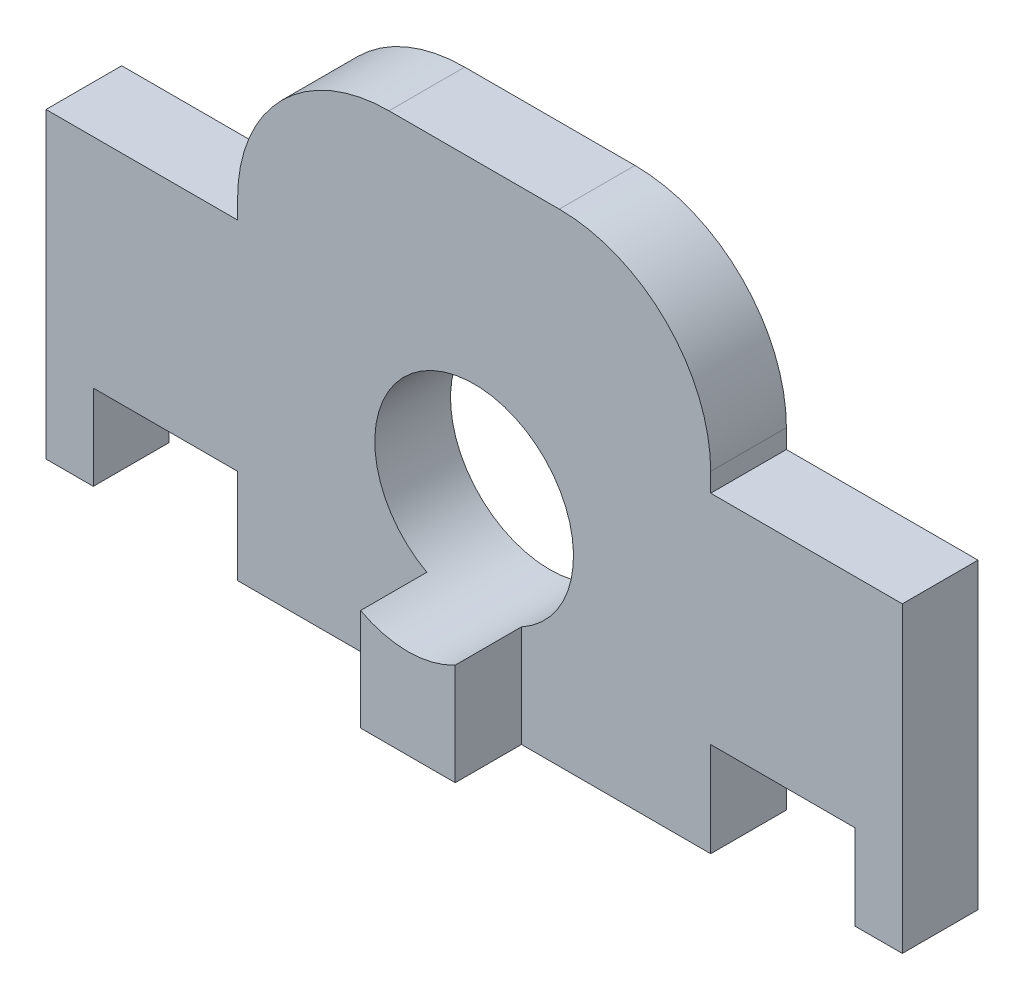
ISO-10303-21;
HEADER;
FILE_DESCRIPTION(('STEP AP214'),'2;1');
FILE_NAME('part.step','',(''),(''),'','','');
FILE_SCHEMA(('AUTOMOTIVE_DESIGN { 1 0 10303 214 1 1 1 1 }'));
ENDSEC;
DATA;
#1=APPLICATION_CONTEXT('core data for automotive mechanical design processes');
#2=APPLICATION_PROTOCOL_DEFINITION('international standard','automotive_design',2000,#1);
#3=PRODUCT_CONTEXT('',#1,'mechanical');
#4=PRODUCT('Part','Part','',(#3));
#5=PRODUCT_RELATED_PRODUCT_CATEGORY('part','',(#4));
#6=PRODUCT_DEFINITION_FORMATION('','',#4);
#7=PRODUCT_DEFINITION_CONTEXT('part definition',#1,'design');
#8=PRODUCT_DEFINITION('design','',#6,#7);
#9=PRODUCT_DEFINITION_SHAPE('','',#8);
#10=(LENGTH_UNIT() NAMED_UNIT(*) SI_UNIT(.MILLI.,.METRE.));
#11=(NAMED_UNIT(*) PLANE_ANGLE_UNIT() SI_UNIT($,.RADIAN.));
#12=(NAMED_UNIT(*) SI_UNIT($,.STERADIAN.) SOLID_ANGLE_UNIT());
#13=UNCERTAINTY_MEASURE_WITH_UNIT(LENGTH_MEASURE(1.E-05),#10,'distance_accuracy_value','');
#14=(GEOMETRIC_REPRESENTATION_CONTEXT(3) GLOBAL_UNCERTAINTY_ASSIGNED_CONTEXT((#13)) GLOBAL_UNIT_ASSIGNED_CONTEXT((#10,
#11,#12)) REPRESENTATION_CONTEXT('',''));
#15=CARTESIAN_POINT('',(0.,0.,0.));
#16=DIRECTION('',(0.,0.,1.));
#17=DIRECTION('',(1.,0.,0.));
#18=AXIS2_PLACEMENT_3D('',#15,#16,#17);
#19=CARTESIAN_POINT('',(0.,-37.205169628433,15.));
#20=DIRECTION('',(0.,1.,0.));
#21=DIRECTION('',(0.,0.,1.));
#22=AXIS2_PLACEMENT_3D('',#19,#20,#21);
#23=PLANE('',#22);
#24=DIRECTION('',(0.,0.,1.));
#25=VECTOR('',#24,1.);
#26=CARTESIAN_POINT('',(-3.92568659127626,-37.205169628433,8.));
#27=LINE('',#26,#25);
#28=CARTESIAN_POINT('',(-3.92568659127626,-37.205169628433,8.));
#29=VERTEX_POINT('',#28);
#30=CARTESIAN_POINT('',(-3.92568659127626,-37.205169628433,15.));
#31=VERTEX_POINT('',#30);
#32=EDGE_CURVE('E350',#29,#31,#27,.T.);
#33=ORIENTED_EDGE('',*,*,#32,.F.);
#34=DIRECTION('',(1.,0.,0.));
#35=VECTOR('',#34,1.);
#36=CARTESIAN_POINT('',(0.,-37.205169628433,8.));
#37=LINE('',#36,#35);
#38=CARTESIAN_POINT('',(-23.9256865912763,-37.205169628433,8.));
#39=VERTEX_POINT('',#38);
#40=EDGE_CURVE('E296',#39,#29,#37,.T.);
#41=ORIENTED_EDGE('',*,*,#40,.F.);
#42=DIRECTION('',(0.,0.,1.));
#43=VECTOR('',#42,1.);
#44=CARTESIAN_POINT('',(-23.9256865912763,-37.205169628433,0.));
#45=LINE('',#44,#43);
#46=CARTESIAN_POINT('',(-23.9256865912763,-37.205169628433,0.));
#47=VERTEX_POINT('',#46);
#48=EDGE_CURVE('E397',#47,#39,#45,.T.);
#49=ORIENTED_EDGE('',*,*,#48,.F.);
#50=DIRECTION('',(1.,0.,0.));
#51=VECTOR('',#50,1.);
#52=CARTESIAN_POINT('',(0.,-37.205169628433,0.));
#53=LINE('',#52,#51);
#54=CARTESIAN_POINT('',(26.0743134087237,-37.205169628433,0.));
#55=VERTEX_POINT('',#54);
#56=EDGE_CURVE('E423',#47,#55,#53,.T.);
#57=ORIENTED_EDGE('',*,*,#56,.T.);
#58=DIRECTION('',(0.,0.,1.));
#59=VECTOR('',#58,1.);
#60=CARTESIAN_POINT('',(26.0743134087237,-37.205169628433,0.));
#61=LINE('',#60,#59);
#62=CARTESIAN_POINT('',(26.0743134087237,-37.205169628433,8.));
#63=VERTEX_POINT('',#62);
#64=EDGE_CURVE('E359',#55,#63,#61,.T.);
#65=ORIENTED_EDGE('',*,*,#64,.T.);
#66=CARTESIAN_POINT('',(6.07431340872374,-37.205169628433,8.));
#67=VERTEX_POINT('',#66);
#68=EDGE_CURVE('E291',#67,#63,#37,.T.);
#69=ORIENTED_EDGE('',*,*,#68,.F.);
#70=DIRECTION('',(0.,0.,1.));
#71=VECTOR('',#70,1.);
#72=CARTESIAN_POINT('',(6.07431340872374,-37.205169628433,8.));
#73=LINE('',#72,#71);
#74=CARTESIAN_POINT('',(6.07431340872374,-37.205169628433,15.));
#75=VERTEX_POINT('',#74);
#76=EDGE_CURVE('E335',#67,#75,#73,.T.);
#77=ORIENTED_EDGE('',*,*,#76,.T.);
#78=DIRECTION('',(1.,0.,0.));
#79=VECTOR('',#78,1.);
#80=CARTESIAN_POINT('',(0.,-37.205169628433,15.));
#81=LINE('',#80,#79);
#82=EDGE_CURVE('E56',#31,#75,#81,.T.);
#83=ORIENTED_EDGE('',*,*,#82,.F.);
#84=EDGE_LOOP('',(#33,#41,#49,#57,#65,#69,#77,#83));
#85=FACE_BOUND('',#84,.T.);
#86=ADVANCED_FACE('F47',(#85),#23,.F.);
#87=CARTESIAN_POINT('',(0.,13.794830371567,15.));
#88=DIRECTION('',(0.,1.,0.));
#89=DIRECTION('',(0.,0.,1.));
#90=AXIS2_PLACEMENT_3D('',#87,#88,#89);
#91=PLANE('',#90);
#92=DIRECTION('',(0.,0.,1.));
#93=VECTOR('',#92,1.);
#94=CARTESIAN_POINT('',(-7.92568659127614,13.794830371567,0.));
#95=LINE('',#94,#93);
#96=CARTESIAN_POINT('',(-7.92568659127614,13.794830371567,0.));
#97=VERTEX_POINT('',#96);
#98=CARTESIAN_POINT('',(-7.92568659127614,13.794830371567,8.));
#99=VERTEX_POINT('',#98);
#100=EDGE_CURVE('E418',#97,#99,#95,.T.);
#101=ORIENTED_EDGE('',*,*,#100,.T.);
#102=DIRECTION('',(-1.,0.,0.));
#103=VECTOR('',#102,1.);
#104=CARTESIAN_POINT('',(0.,13.794830371567,8.));
#105=LINE('',#104,#103);
#106=CARTESIAN_POINT('',(10.0743134087236,13.794830371567,8.));
#107=VERTEX_POINT('',#106);
#108=EDGE_CURVE('E310',#107,#99,#105,.T.);
#109=ORIENTED_EDGE('',*,*,#108,.F.);
#110=DIRECTION('',(0.,0.,1.));
#111=VECTOR('',#110,1.);
#112=CARTESIAN_POINT('',(10.0743134087236,13.794830371567,0.));
#113=LINE('',#112,#111);
#114=CARTESIAN_POINT('',(10.0743134087236,13.794830371567,0.));
#115=VERTEX_POINT('',#114);
#116=EDGE_CURVE('E372',#115,#107,#113,.T.);
#117=ORIENTED_EDGE('',*,*,#116,.F.);
#118=DIRECTION('',(1.,0.,0.));
#119=VECTOR('',#118,1.);
#120=CARTESIAN_POINT('',(0.,13.794830371567,0.));
#121=LINE('',#120,#119);
#122=EDGE_CURVE('E436',#97,#115,#121,.T.);
#123=ORIENTED_EDGE('',*,*,#122,.F.);
#124=EDGE_LOOP('',(#101,#109,#117,#123));
#125=FACE_BOUND('',#124,.T.);
#126=ADVANCED_FACE('F483',(#125),#91,.T.);
#127=CARTESIAN_POINT('',(0.,0.,15.));
#128=DIRECTION('',(0.,0.,1.));
#129=DIRECTION('',(1.,0.,0.));
#130=AXIS2_PLACEMENT_3D('',#127,#128,#129);
#131=PLANE('',#130);
#132=ORIENTED_EDGE('',*,*,#82,.T.);
#133=DIRECTION('',(0.,1.,0.));
#134=VECTOR('',#133,1.);
#135=CARTESIAN_POINT('',(6.07431340872374,0.,15.));
#136=LINE('',#135,#134);
#137=CARTESIAN_POINT('',(6.07431340872374,-26.4382622847427,15.));
#138=VERTEX_POINT('',#137);
#139=EDGE_CURVE('E287',#75,#138,#136,.T.);
#140=ORIENTED_EDGE('',*,*,#139,.T.);
#141=CARTESIAN_POINT('',(1.07431340872375,-17.205169628433,15.));
#142=DIRECTION('',(0.,0.,1.));
#143=DIRECTION('',(1.,0.,0.));
#144=AXIS2_PLACEMENT_3D('',#141,#142,#143);
#145=CIRCLE('',#144,10.5);
#146=CARTESIAN_POINT('',(-3.92568659127626,-26.4382622847426,15.));
#147=VERTEX_POINT('',#146);
#148=EDGE_CURVE('E11',#147,#138,#145,.T.);
#149=ORIENTED_EDGE('',*,*,#148,.F.);
#150=DIRECTION('',(0.,-1.,0.));
#151=VECTOR('',#150,1.);
#152=CARTESIAN_POINT('',(-3.92568659127626,0.,15.));
#153=LINE('',#152,#151);
#154=EDGE_CURVE('E292',#147,#31,#153,.T.);
#155=ORIENTED_EDGE('',*,*,#154,.T.);
#156=EDGE_LOOP('',(#132,#140,#149,#155));
#157=FACE_BOUND('',#156,.T.);
#158=ADVANCED_FACE('F452',(#157),#131,.T.);
#159=CARTESIAN_POINT('',(1.07431340872375,-17.205169628433,15.));
#160=DIRECTION('',(0.,0.,-1.));
#161=DIRECTION('',(-1.,0.,0.));
#162=AXIS2_PLACEMENT_3D('',#159,#160,#161);
#163=CYLINDRICAL_SURFACE('',#162,10.5);
#164=CARTESIAN_POINT('',(1.07431340872375,-17.205169628433,0.));
#165=DIRECTION('',(0.,0.,1.));
#166=DIRECTION('',(1.,0.,0.));
#167=AXIS2_PLACEMENT_3D('',#164,#165,#166);
#168=CIRCLE('',#167,10.5);
#169=CARTESIAN_POINT('',(11.5743134087238,-17.205169628433,0.));
#170=VERTEX_POINT('',#169);
#171=EDGE_CURVE('E50',#170,#170,#168,.T.);
#172=ORIENTED_EDGE('',*,*,#171,.F.);
#173=EDGE_LOOP('',(#172));
#174=FACE_BOUND('',#173,.T.);
#175=ORIENTED_EDGE('',*,*,#148,.T.);
#176=DIRECTION('',(0.,0.,1.));
#177=VECTOR('',#176,1.);
#178=CARTESIAN_POINT('',(6.07431340872374,-26.4382622847427,8.));
#179=LINE('',#178,#177);
#180=CARTESIAN_POINT('',(6.07431340872374,-26.4382622847427,8.));
#181=VERTEX_POINT('',#180);
#182=EDGE_CURVE('E342',#181,#138,#179,.T.);
#183=ORIENTED_EDGE('',*,*,#182,.F.);
#184=CARTESIAN_POINT('',(1.07431340872375,-17.205169628433,8.));
#185=DIRECTION('',(0.,0.,1.));
#186=DIRECTION('',(1.,0.,0.));
#187=AXIS2_PLACEMENT_3D('',#184,#185,#186);
#188=CIRCLE('',#187,10.5);
#189=CARTESIAN_POINT('',(-3.92568659127626,-26.4382622847426,8.));
#190=VERTEX_POINT('',#189);
#191=EDGE_CURVE('E331',#190,#181,#188,.F.);
#192=ORIENTED_EDGE('',*,*,#191,.F.);
#193=DIRECTION('',(0.,0.,1.));
#194=VECTOR('',#193,1.);
#195=CARTESIAN_POINT('',(-3.92568659127626,-26.4382622847426,8.));
#196=LINE('',#195,#194);
#197=EDGE_CURVE('E346',#190,#147,#196,.T.);
#198=ORIENTED_EDGE('',*,*,#197,.T.);
#199=EDGE_LOOP('',(#175,#183,#192,#198));
#200=FACE_BOUND('',#199,.T.);
#201=ADVANCED_FACE('F448',(#174,#200),#163,.F.);
#202=CARTESIAN_POINT('',(-7.92568659127625,-2.20516962843295,0.));
#203=DIRECTION('',(0.,0.,1.));
#204=DIRECTION('',(1.,0.,0.));
#205=AXIS2_PLACEMENT_3D('',#202,#203,#204);
#206=CYLINDRICAL_SURFACE('',#205,16.);
#207=DIRECTION('',(0.,0.,1.));
#208=VECTOR('',#207,1.);
#209=CARTESIAN_POINT('',(-23.9256865912762,-2.20516962843307,0.));
#210=LINE('',#209,#208);
#211=CARTESIAN_POINT('',(-23.9256865912762,-2.20516962843307,0.));
#212=VERTEX_POINT('',#211);
#213=CARTESIAN_POINT('',(-23.9256865912762,-2.20516962843307,8.));
#214=VERTEX_POINT('',#213);
#215=EDGE_CURVE('E419',#212,#214,#210,.T.);
#216=ORIENTED_EDGE('',*,*,#215,.T.);
#217=CARTESIAN_POINT('',(-7.92568659127625,-2.20516962843295,8.));
#218=DIRECTION('',(0.,0.,1.));
#219=DIRECTION('',(1.,0.,0.));
#220=AXIS2_PLACEMENT_3D('',#217,#218,#219);
#221=CIRCLE('',#220,16.);
#222=EDGE_CURVE('E313',#99,#214,#221,.T.);
#223=ORIENTED_EDGE('',*,*,#222,.F.);
#224=ORIENTED_EDGE('',*,*,#100,.F.);
#225=CARTESIAN_POINT('',(-7.92568659127625,-2.20516962843295,0.));
#226=DIRECTION('',(0.,0.,1.));
#227=DIRECTION('',(1.,0.,0.));
#228=AXIS2_PLACEMENT_3D('',#225,#226,#227);
#229=CIRCLE('',#228,16.);
#230=EDGE_CURVE('E393',#97,#212,#229,.T.);
#231=ORIENTED_EDGE('',*,*,#230,.T.);
#232=EDGE_LOOP('',(#216,#223,#224,#231));
#233=FACE_BOUND('',#232,.T.);
#234=ADVANCED_FACE('F451',(#233),#206,.T.);
#235=CARTESIAN_POINT('',(-23.9256865912762,0.,0.));
#236=DIRECTION('',(-1.,0.,0.));
#237=DIRECTION('',(0.,0.,1.));
#238=AXIS2_PLACEMENT_3D('',#235,#236,#237);
#239=PLANE('',#238);
#240=DIRECTION('',(0.,0.,1.));
#241=VECTOR('',#240,1.);
#242=CARTESIAN_POINT('',(-23.9256865912762,-4.20516962843296,0.));
#243=LINE('',#242,#241);
#244=CARTESIAN_POINT('',(-23.9256865912762,-4.20516962843296,0.));
#245=VERTEX_POINT('',#244);
#246=CARTESIAN_POINT('',(-23.9256865912762,-4.20516962843296,8.));
#247=VERTEX_POINT('',#246);
#248=EDGE_CURVE('E424',#245,#247,#243,.T.);
#249=ORIENTED_EDGE('',*,*,#248,.T.);
#250=DIRECTION('',(0.,-1.,0.));
#251=VECTOR('',#250,1.);
#252=CARTESIAN_POINT('',(-23.9256865912762,0.,8.));
#253=LINE('',#252,#251);
#254=EDGE_CURVE('E316',#214,#247,#253,.T.);
#255=ORIENTED_EDGE('',*,*,#254,.F.);
#256=ORIENTED_EDGE('',*,*,#215,.F.);
#257=DIRECTION('',(0.,-1.,0.));
#258=VECTOR('',#257,1.);
#259=CARTESIAN_POINT('',(-23.9256865912762,0.,0.));
#260=LINE('',#259,#258);
#261=EDGE_CURVE('E414',#212,#245,#260,.T.);
#262=ORIENTED_EDGE('',*,*,#261,.T.);
#263=EDGE_LOOP('',(#249,#255,#256,#262));
#264=FACE_BOUND('',#263,.T.);
#265=ADVANCED_FACE('F488',(#264),#239,.T.);
#266=CARTESIAN_POINT('',(0.,-4.20516962843296,0.));
#267=DIRECTION('',(0.,-1.,0.));
#268=DIRECTION('',(0.,0.,-1.));
#269=AXIS2_PLACEMENT_3D('',#266,#267,#268);
#270=PLANE('',#269);
#271=DIRECTION('',(-1.,0.,0.));
#272=VECTOR('',#271,1.);
#273=CARTESIAN_POINT('',(0.,-4.20516962843296,8.));
#274=LINE('',#273,#272);
#275=CARTESIAN_POINT('',(-44.1756865912762,-4.20516962843296,8.));
#276=VERTEX_POINT('',#275);
#277=EDGE_CURVE('E319',#247,#276,#274,.T.);
#278=ORIENTED_EDGE('',*,*,#277,.F.);
#279=ORIENTED_EDGE('',*,*,#248,.F.);
#280=DIRECTION('',(1.,0.,0.));
#281=VECTOR('',#280,1.);
#282=CARTESIAN_POINT('',(0.,-4.20516962843296,0.));
#283=LINE('',#282,#281);
#284=CARTESIAN_POINT('',(-44.1756865912762,-4.20516962843296,0.));
#285=VERTEX_POINT('',#284);
#286=EDGE_CURVE('E410',#285,#245,#283,.T.);
#287=ORIENTED_EDGE('',*,*,#286,.F.);
#288=DIRECTION('',(0.,0.,1.));
#289=VECTOR('',#288,1.);
#290=CARTESIAN_POINT('',(-44.1756865912762,-4.20516962843296,0.));
#291=LINE('',#290,#289);
#292=EDGE_CURVE('E249',#285,#276,#291,.T.);
#293=ORIENTED_EDGE('',*,*,#292,.T.);
#294=EDGE_LOOP('',(#278,#279,#287,#293));
#295=FACE_BOUND('',#294,.T.);
#296=ADVANCED_FACE('F493',(#295),#270,.F.);
#297=CARTESIAN_POINT('',(26.0743134087237,-37.205169628433,0.));
#298=DIRECTION('',(1.,0.,0.));
#299=DIRECTION('',(0.,0.,-1.));
#300=AXIS2_PLACEMENT_3D('',#297,#298,#299);
#301=PLANE('',#300);
#302=DIRECTION('',(0.,0.,1.));
#303=VECTOR('',#302,1.);
#304=CARTESIAN_POINT('',(26.0743134087237,-27.205169628433,0.));
#305=LINE('',#304,#303);
#306=CARTESIAN_POINT('',(26.0743134087237,-27.205169628433,0.));
#307=VERTEX_POINT('',#306);
#308=CARTESIAN_POINT('',(26.0743134087237,-27.205169628433,8.));
#309=VERTEX_POINT('',#308);
#310=EDGE_CURVE('E345',#307,#309,#305,.T.);
#311=ORIENTED_EDGE('',*,*,#310,.T.);
#312=DIRECTION('',(0.,1.,0.));
#313=VECTOR('',#312,1.);
#314=CARTESIAN_POINT('',(26.0743134087237,0.,8.));
#315=LINE('',#314,#313);
#316=EDGE_CURVE('E295',#63,#309,#315,.T.);
#317=ORIENTED_EDGE('',*,*,#316,.F.);
#318=ORIENTED_EDGE('',*,*,#64,.F.);
#319=DIRECTION('',(0.,1.,0.));
#320=VECTOR('',#319,1.);
#321=CARTESIAN_POINT('',(26.0743134087237,-37.205169628433,0.));
#322=LINE('',#321,#320);
#323=EDGE_CURVE('E367',#55,#307,#322,.T.);
#324=ORIENTED_EDGE('',*,*,#323,.T.);
#325=EDGE_LOOP('',(#311,#317,#318,#324));
#326=FACE_BOUND('',#325,.T.);
#327=ADVANCED_FACE('F467',(#326),#301,.T.);
#328=CARTESIAN_POINT('',(26.0743134087237,-27.205169628433,0.));
#329=DIRECTION('',(0.,-1.,0.));
#330=DIRECTION('',(0.,0.,-1.));
#331=AXIS2_PLACEMENT_3D('',#328,#329,#330);
#332=PLANE('',#331);
#333=DIRECTION('',(1.,0.,0.));
#334=VECTOR('',#333,1.);
#335=CARTESIAN_POINT('',(26.0743134087237,-27.205169628433,0.));
#336=LINE('',#335,#334);
#337=CARTESIAN_POINT('',(41.3243134087237,-27.205169628433,0.));
#338=VERTEX_POINT('',#337);
#339=EDGE_CURVE('E363',#307,#338,#336,.T.);
#340=ORIENTED_EDGE('',*,*,#339,.T.);
#341=DIRECTION('',(0.,0.,1.));
#342=VECTOR('',#341,1.);
#343=CARTESIAN_POINT('',(41.3243134087237,-27.205169628433,0.));
#344=LINE('',#343,#342);
#345=CARTESIAN_POINT('',(41.3243134087237,-27.205169628433,8.));
#346=VERTEX_POINT('',#345);
#347=EDGE_CURVE('E239',#338,#346,#344,.T.);
#348=ORIENTED_EDGE('',*,*,#347,.T.);
#349=DIRECTION('',(1.,0.,0.));
#350=VECTOR('',#349,1.);
#351=CARTESIAN_POINT('',(0.,-27.205169628433,8.));
#352=LINE('',#351,#350);
#353=EDGE_CURVE('E299',#309,#346,#352,.T.);
#354=ORIENTED_EDGE('',*,*,#353,.F.);
#355=ORIENTED_EDGE('',*,*,#310,.F.);
#356=EDGE_LOOP('',(#340,#348,#354,#355));
#357=FACE_BOUND('',#356,.T.);
#358=ADVANCED_FACE('F471',(#357),#332,.T.);
#359=CARTESIAN_POINT('',(-33.9256865912763,-27.205169628433,0.));
#360=DIRECTION('',(0.,-1.,0.));
#361=DIRECTION('',(0.,0.,-1.));
#362=AXIS2_PLACEMENT_3D('',#359,#360,#361);
#363=PLANE('',#362);
#364=DIRECTION('',(0.,0.,1.));
#365=VECTOR('',#364,1.);
#366=CARTESIAN_POINT('',(-23.9256865912763,-27.205169628433,0.));
#367=LINE('',#366,#365);
#368=CARTESIAN_POINT('',(-23.9256865912763,-27.205169628433,0.));
#369=VERTEX_POINT('',#368);
#370=CARTESIAN_POINT('',(-23.9256865912763,-27.205169628433,8.));
#371=VERTEX_POINT('',#370);
#372=EDGE_CURVE('E371',#369,#371,#367,.T.);
#373=ORIENTED_EDGE('',*,*,#372,.T.);
#374=DIRECTION('',(1.,0.,0.));
#375=VECTOR('',#374,1.);
#376=CARTESIAN_POINT('',(0.,-27.205169628433,8.));
#377=LINE('',#376,#375);
#378=CARTESIAN_POINT('',(-39.1756865912763,-27.205169628433,8.));
#379=VERTEX_POINT('',#378);
#380=EDGE_CURVE('E322',#379,#371,#377,.T.);
#381=ORIENTED_EDGE('',*,*,#380,.F.);
#382=DIRECTION('',(0.,0.,1.));
#383=VECTOR('',#382,1.);
#384=CARTESIAN_POINT('',(-39.1756865912763,-27.205169628433,0.));
#385=LINE('',#384,#383);
#386=CARTESIAN_POINT('',(-39.1756865912763,-27.205169628433,0.));
#387=VERTEX_POINT('',#386);
#388=EDGE_CURVE('E272',#387,#379,#385,.T.);
#389=ORIENTED_EDGE('',*,*,#388,.F.);
#390=DIRECTION('',(1.,0.,0.));
#391=VECTOR('',#390,1.);
#392=CARTESIAN_POINT('',(-33.9256865912763,-27.205169628433,0.));
#393=LINE('',#392,#391);
#394=EDGE_CURVE('E384',#387,#369,#393,.T.);
#395=ORIENTED_EDGE('',*,*,#394,.T.);
#396=EDGE_LOOP('',(#373,#381,#389,#395));
#397=FACE_BOUND('',#396,.T.);
#398=ADVANCED_FACE('F508',(#397),#363,.T.);
#399=CARTESIAN_POINT('',(-23.9256865912763,-37.205169628433,0.));
#400=DIRECTION('',(1.,0.,0.));
#401=DIRECTION('',(0.,0.,-1.));
#402=AXIS2_PLACEMENT_3D('',#399,#400,#401);
#403=PLANE('',#402);
#404=DIRECTION('',(0.,-1.,0.));
#405=VECTOR('',#404,1.);
#406=CARTESIAN_POINT('',(-23.9256865912763,0.,8.));
#407=LINE('',#406,#405);
#408=EDGE_CURVE('E325',#371,#39,#407,.T.);
#409=ORIENTED_EDGE('',*,*,#408,.F.);
#410=ORIENTED_EDGE('',*,*,#372,.F.);
#411=DIRECTION('',(0.,1.,0.));
#412=VECTOR('',#411,1.);
#413=CARTESIAN_POINT('',(-23.9256865912763,-37.205169628433,0.));
#414=LINE('',#413,#412);
#415=EDGE_CURVE('E401',#47,#369,#414,.T.);
#416=ORIENTED_EDGE('',*,*,#415,.F.);
#417=ORIENTED_EDGE('',*,*,#48,.T.);
#418=EDGE_LOOP('',(#409,#410,#416,#417));
#419=FACE_BOUND('',#418,.T.);
#420=ADVANCED_FACE('F513',(#419),#403,.F.);
#421=CARTESIAN_POINT('',(0.,-4.20516962843296,0.));
#422=DIRECTION('',(0.,1.,0.));
#423=DIRECTION('',(-1.,0.,0.));
#424=AXIS2_PLACEMENT_3D('',#421,#422,#423);
#425=PLANE('',#424);
#426=DIRECTION('',(0.,0.,1.));
#427=VECTOR('',#426,1.);
#428=CARTESIAN_POINT('',(26.0743134087237,-4.20516962843296,0.));
#429=LINE('',#428,#427);
#430=CARTESIAN_POINT('',(26.0743134087237,-4.20516962843296,0.));
#431=VERTEX_POINT('',#430);
#432=CARTESIAN_POINT('',(26.0743134087237,-4.20516962843296,8.));
#433=VERTEX_POINT('',#432);
#434=EDGE_CURVE('E380',#431,#433,#429,.T.);
#435=ORIENTED_EDGE('',*,*,#434,.T.);
#436=DIRECTION('',(-1.,0.,0.));
#437=VECTOR('',#436,1.);
#438=CARTESIAN_POINT('',(0.,-4.20516962843296,8.));
#439=LINE('',#438,#437);
#440=CARTESIAN_POINT('',(46.3243134087237,-4.20516962843296,8.));
#441=VERTEX_POINT('',#440);
#442=EDGE_CURVE('E302',#441,#433,#439,.T.);
#443=ORIENTED_EDGE('',*,*,#442,.F.);
#444=DIRECTION('',(0.,0.,-1.));
#445=VECTOR('',#444,1.);
#446=CARTESIAN_POINT('',(46.3243134087237,-4.20516962843296,0.));
#447=LINE('',#446,#445);
#448=CARTESIAN_POINT('',(46.3243134087237,-4.20516962843296,0.));
#449=VERTEX_POINT('',#448);
#450=EDGE_CURVE('E207',#441,#449,#447,.T.);
#451=ORIENTED_EDGE('',*,*,#450,.T.);
#452=DIRECTION('',(-1.,0.,0.));
#453=VECTOR('',#452,1.);
#454=CARTESIAN_POINT('',(0.,-4.20516962843296,0.));
#455=LINE('',#454,#453);
#456=EDGE_CURVE('E376',#449,#431,#455,.T.);
#457=ORIENTED_EDGE('',*,*,#456,.T.);
#458=EDGE_LOOP('',(#435,#443,#451,#457));
#459=FACE_BOUND('',#458,.T.);
#460=ADVANCED_FACE('F475',(#459),#425,.T.);
#461=CARTESIAN_POINT('',(26.0743134087237,0.,0.));
#462=DIRECTION('',(-1.,0.,0.));
#463=DIRECTION('',(0.,0.,1.));
#464=AXIS2_PLACEMENT_3D('',#461,#462,#463);
#465=PLANE('',#464);
#466=DIRECTION('',(0.,1.,0.));
#467=VECTOR('',#466,1.);
#468=CARTESIAN_POINT('',(26.0743134087237,0.,8.));
#469=LINE('',#468,#467);
#470=CARTESIAN_POINT('',(26.0743134087237,-2.20516962843307,8.));
#471=VERTEX_POINT('',#470);
#472=EDGE_CURVE('E64',#433,#471,#469,.T.);
#473=ORIENTED_EDGE('',*,*,#472,.F.);
#474=ORIENTED_EDGE('',*,*,#434,.F.);
#475=DIRECTION('',(0.,-1.,0.));
#476=VECTOR('',#475,1.);
#477=CARTESIAN_POINT('',(26.0743134087237,0.,0.));
#478=LINE('',#477,#476);
#479=CARTESIAN_POINT('',(26.0743134087237,-2.20516962843296,0.));
#480=VERTEX_POINT('',#479);
#481=EDGE_CURVE('E72',#480,#431,#478,.T.);
#482=ORIENTED_EDGE('',*,*,#481,.F.);
#483=DIRECTION('',(0.,0.,1.));
#484=VECTOR('',#483,1.);
#485=CARTESIAN_POINT('',(26.0743134087237,-2.20516962843307,0.));
#486=LINE('',#485,#484);
#487=EDGE_CURVE('E377',#480,#471,#486,.T.);
#488=ORIENTED_EDGE('',*,*,#487,.T.);
#489=EDGE_LOOP('',(#473,#474,#482,#488));
#490=FACE_BOUND('',#489,.T.);
#491=ADVANCED_FACE('F476',(#490),#465,.F.);
#492=CARTESIAN_POINT('',(10.0743134087237,-2.20516962843296,0.));
#493=DIRECTION('',(0.,0.,1.));
#494=DIRECTION('',(1.,0.,0.));
#495=AXIS2_PLACEMENT_3D('',#492,#493,#494);
#496=CYLINDRICAL_SURFACE('',#495,16.);
#497=CARTESIAN_POINT('',(10.0743134087237,-2.20516962843296,8.));
#498=DIRECTION('',(0.,0.,1.));
#499=DIRECTION('',(1.,0.,0.));
#500=AXIS2_PLACEMENT_3D('',#497,#498,#499);
#501=CIRCLE('',#500,16.);
#502=EDGE_CURVE('E307',#471,#107,#501,.T.);
#503=ORIENTED_EDGE('',*,*,#502,.F.);
#504=ORIENTED_EDGE('',*,*,#487,.F.);
#505=CARTESIAN_POINT('',(10.0743134087237,-2.20516962843296,0.));
#506=DIRECTION('',(0.,0.,1.));
#507=DIRECTION('',(1.,0.,0.));
#508=AXIS2_PLACEMENT_3D('',#505,#506,#507);
#509=CIRCLE('',#508,16.);
#510=EDGE_CURVE('E389',#115,#480,#509,.F.);
#511=ORIENTED_EDGE('',*,*,#510,.F.);
#512=ORIENTED_EDGE('',*,*,#116,.T.);
#513=EDGE_LOOP('',(#503,#504,#511,#512));
#514=FACE_BOUND('',#513,.T.);
#515=ADVANCED_FACE('F478',(#514),#496,.T.);
#516=CARTESIAN_POINT('',(0.,0.,0.));
#517=DIRECTION('',(0.,0.,1.));
#518=DIRECTION('',(1.,0.,0.));
#519=AXIS2_PLACEMENT_3D('',#516,#517,#518);
#520=PLANE('',#519);
#521=ORIENTED_EDGE('',*,*,#171,.T.);
#522=EDGE_LOOP('',(#521));
#523=FACE_BOUND('',#522,.T.);
#524=ORIENTED_EDGE('',*,*,#456,.F.);
#525=DIRECTION('',(0.,1.,0.));
#526=VECTOR('',#525,1.);
#527=CARTESIAN_POINT('',(46.3243134087237,-36.205169628433,0.));
#528=LINE('',#527,#526);
#529=CARTESIAN_POINT('',(46.3243134087237,-36.205169628433,0.));
#530=VERTEX_POINT('',#529);
#531=EDGE_CURVE('E210',#530,#449,#528,.T.);
#532=ORIENTED_EDGE('',*,*,#531,.F.);
#533=DIRECTION('',(1.,0.,0.));
#534=VECTOR('',#533,1.);
#535=CARTESIAN_POINT('',(0.,-36.205169628433,0.));
#536=LINE('',#535,#534);
#537=CARTESIAN_POINT('',(41.3243134087237,-36.205169628433,0.));
#538=VERTEX_POINT('',#537);
#539=EDGE_CURVE('E220',#538,#530,#536,.T.);
#540=ORIENTED_EDGE('',*,*,#539,.F.);
#541=DIRECTION('',(0.,1.,0.));
#542=VECTOR('',#541,1.);
#543=CARTESIAN_POINT('',(41.3243134087237,-36.205169628433,0.));
#544=LINE('',#543,#542);
#545=EDGE_CURVE('E240',#538,#338,#544,.T.);
#546=ORIENTED_EDGE('',*,*,#545,.T.);
#547=ORIENTED_EDGE('',*,*,#339,.F.);
#548=ORIENTED_EDGE('',*,*,#323,.F.);
#549=ORIENTED_EDGE('',*,*,#56,.F.);
#550=ORIENTED_EDGE('',*,*,#415,.T.);
#551=ORIENTED_EDGE('',*,*,#394,.F.);
#552=DIRECTION('',(0.,1.,0.));
#553=VECTOR('',#552,1.);
#554=CARTESIAN_POINT('',(-39.1756865912763,-36.205169628433,0.));
#555=LINE('',#554,#553);
#556=CARTESIAN_POINT('',(-39.1756865912763,-36.205169628433,0.));
#557=VERTEX_POINT('',#556);
#558=EDGE_CURVE('E268',#557,#387,#555,.T.);
#559=ORIENTED_EDGE('',*,*,#558,.F.);
#560=DIRECTION('',(-1.,0.,0.));
#561=VECTOR('',#560,1.);
#562=CARTESIAN_POINT('',(0.,-36.205169628433,0.));
#563=LINE('',#562,#561);
#564=CARTESIAN_POINT('',(-44.1756865912762,-36.205169628433,0.));
#565=VERTEX_POINT('',#564);
#566=EDGE_CURVE('E250',#557,#565,#563,.T.);
#567=ORIENTED_EDGE('',*,*,#566,.T.);
#568=DIRECTION('',(0.,1.,0.));
#569=VECTOR('',#568,1.);
#570=CARTESIAN_POINT('',(-44.1756865912762,-36.205169628433,0.));
#571=LINE('',#570,#569);
#572=EDGE_CURVE('E264',#565,#285,#571,.T.);
#573=ORIENTED_EDGE('',*,*,#572,.T.);
#574=ORIENTED_EDGE('',*,*,#286,.T.);
#575=ORIENTED_EDGE('',*,*,#261,.F.);
#576=ORIENTED_EDGE('',*,*,#230,.F.);
#577=ORIENTED_EDGE('',*,*,#122,.T.);
#578=ORIENTED_EDGE('',*,*,#510,.T.);
#579=ORIENTED_EDGE('',*,*,#481,.T.);
#580=EDGE_LOOP('',(#524,#532,#540,#546,#547,#548,#549,#550,#551,#559,#567,#573,#574,#575,#576,
#577,#578,#579));
#581=FACE_BOUND('',#580,.T.);
#582=ADVANCED_FACE('F446',(#523,#581),#520,.F.);
#583=CARTESIAN_POINT('',(6.07431340872374,0.,8.));
#584=DIRECTION('',(1.,0.,0.));
#585=DIRECTION('',(0.,0.,-1.));
#586=AXIS2_PLACEMENT_3D('',#583,#584,#585);
#587=PLANE('',#586);
#588=ORIENTED_EDGE('',*,*,#139,.F.);
#589=ORIENTED_EDGE('',*,*,#76,.F.);
#590=DIRECTION('',(0.,1.,0.));
#591=VECTOR('',#590,1.);
#592=CARTESIAN_POINT('',(6.07431340872374,0.,8.));
#593=LINE('',#592,#591);
#594=EDGE_CURVE('E288',#67,#181,#593,.T.);
#595=ORIENTED_EDGE('',*,*,#594,.T.);
#596=ORIENTED_EDGE('',*,*,#182,.T.);
#597=EDGE_LOOP('',(#588,#589,#595,#596));
#598=FACE_BOUND('',#597,.T.);
#599=ADVANCED_FACE('F460',(#598),#587,.T.);
#600=CARTESIAN_POINT('',(-3.92568659127626,0.,8.));
#601=DIRECTION('',(-1.,0.,0.));
#602=DIRECTION('',(0.,0.,1.));
#603=AXIS2_PLACEMENT_3D('',#600,#601,#602);
#604=PLANE('',#603);
#605=ORIENTED_EDGE('',*,*,#154,.F.);
#606=ORIENTED_EDGE('',*,*,#197,.F.);
#607=DIRECTION('',(0.,-1.,0.));
#608=VECTOR('',#607,1.);
#609=CARTESIAN_POINT('',(-3.92568659127626,0.,8.));
#610=LINE('',#609,#608);
#611=EDGE_CURVE('E328',#190,#29,#610,.T.);
#612=ORIENTED_EDGE('',*,*,#611,.T.);
#613=ORIENTED_EDGE('',*,*,#32,.T.);
#614=EDGE_LOOP('',(#605,#606,#612,#613));
#615=FACE_BOUND('',#614,.T.);
#616=ADVANCED_FACE('F519',(#615),#604,.T.);
#617=CARTESIAN_POINT('',(0.,0.,8.));
#618=DIRECTION('',(0.,0.,1.));
#619=DIRECTION('',(1.,0.,0.));
#620=AXIS2_PLACEMENT_3D('',#617,#618,#619);
#621=PLANE('',#620);
#622=ORIENTED_EDGE('',*,*,#594,.F.);
#623=ORIENTED_EDGE('',*,*,#68,.T.);
#624=ORIENTED_EDGE('',*,*,#316,.T.);
#625=ORIENTED_EDGE('',*,*,#353,.T.);
#626=DIRECTION('',(0.,1.,0.));
#627=VECTOR('',#626,1.);
#628=CARTESIAN_POINT('',(41.3243134087237,-36.205169628433,8.));
#629=LINE('',#628,#627);
#630=CARTESIAN_POINT('',(41.3243134087237,-36.205169628433,8.));
#631=VERTEX_POINT('',#630);
#632=EDGE_CURVE('E227',#631,#346,#629,.T.);
#633=ORIENTED_EDGE('',*,*,#632,.F.);
#634=DIRECTION('',(1.,0.,0.));
#635=VECTOR('',#634,1.);
#636=CARTESIAN_POINT('',(0.,-36.205169628433,8.));
#637=LINE('',#636,#635);
#638=CARTESIAN_POINT('',(46.3243134087237,-36.205169628433,8.));
#639=VERTEX_POINT('',#638);
#640=EDGE_CURVE('E217',#631,#639,#637,.T.);
#641=ORIENTED_EDGE('',*,*,#640,.T.);
#642=DIRECTION('',(0.,1.,0.));
#643=VECTOR('',#642,1.);
#644=CARTESIAN_POINT('',(46.3243134087237,-36.205169628433,8.));
#645=LINE('',#644,#643);
#646=EDGE_CURVE('E201',#639,#441,#645,.T.);
#647=ORIENTED_EDGE('',*,*,#646,.T.);
#648=ORIENTED_EDGE('',*,*,#442,.T.);
#649=ORIENTED_EDGE('',*,*,#472,.T.);
#650=ORIENTED_EDGE('',*,*,#502,.T.);
#651=ORIENTED_EDGE('',*,*,#108,.T.);
#652=ORIENTED_EDGE('',*,*,#222,.T.);
#653=ORIENTED_EDGE('',*,*,#254,.T.);
#654=ORIENTED_EDGE('',*,*,#277,.T.);
#655=DIRECTION('',(0.,1.,0.));
#656=VECTOR('',#655,1.);
#657=CARTESIAN_POINT('',(-44.1756865912762,-36.205169628433,8.));
#658=LINE('',#657,#656);
#659=CARTESIAN_POINT('',(-44.1756865912762,-36.205169628433,8.));
#660=VERTEX_POINT('',#659);
#661=EDGE_CURVE('E277',#660,#276,#658,.T.);
#662=ORIENTED_EDGE('',*,*,#661,.F.);
#663=DIRECTION('',(-1.,0.,0.));
#664=VECTOR('',#663,1.);
#665=CARTESIAN_POINT('',(0.,-36.205169628433,8.));
#666=LINE('',#665,#664);
#667=CARTESIAN_POINT('',(-39.1756865912763,-36.205169628433,8.));
#668=VERTEX_POINT('',#667);
#669=EDGE_CURVE('E258',#668,#660,#666,.T.);
#670=ORIENTED_EDGE('',*,*,#669,.F.);
#671=DIRECTION('',(0.,1.,0.));
#672=VECTOR('',#671,1.);
#673=CARTESIAN_POINT('',(-39.1756865912763,-36.205169628433,8.));
#674=LINE('',#673,#672);
#675=EDGE_CURVE('E273',#668,#379,#674,.T.);
#676=ORIENTED_EDGE('',*,*,#675,.T.);
#677=ORIENTED_EDGE('',*,*,#380,.T.);
#678=ORIENTED_EDGE('',*,*,#408,.T.);
#679=ORIENTED_EDGE('',*,*,#40,.T.);
#680=ORIENTED_EDGE('',*,*,#611,.F.);
#681=ORIENTED_EDGE('',*,*,#191,.T.);
#682=EDGE_LOOP('',(#622,#623,#624,#625,#633,#641,#647,#648,#649,#650,#651,#652,#653,#654,#662,
#670,#676,#677,#678,#679,#680,#681));
#683=FACE_BOUND('',#682,.T.);
#684=ADVANCED_FACE('F225',(#683),#621,.T.);
#685=CARTESIAN_POINT('',(-39.1756865912763,-36.205169628433,0.));
#686=DIRECTION('',(-1.,0.,0.));
#687=DIRECTION('',(0.,0.,1.));
#688=AXIS2_PLACEMENT_3D('',#685,#686,#687);
#689=PLANE('',#688);
#690=ORIENTED_EDGE('',*,*,#558,.T.);
#691=ORIENTED_EDGE('',*,*,#388,.T.);
#692=ORIENTED_EDGE('',*,*,#675,.F.);
#693=DIRECTION('',(0.,0.,1.));
#694=VECTOR('',#693,1.);
#695=CARTESIAN_POINT('',(-39.1756865912763,-36.205169628433,0.));
#696=LINE('',#695,#694);
#697=EDGE_CURVE('E261',#557,#668,#696,.T.);
#698=ORIENTED_EDGE('',*,*,#697,.F.);
#699=EDGE_LOOP('',(#690,#691,#692,#698));
#700=FACE_BOUND('',#699,.T.);
#701=ADVANCED_FACE('F505',(#700),#689,.F.);
#702=CARTESIAN_POINT('',(-44.1756865912762,-36.205169628433,0.));
#703=DIRECTION('',(-1.,0.,0.));
#704=DIRECTION('',(0.,0.,1.));
#705=AXIS2_PLACEMENT_3D('',#702,#703,#704);
#706=PLANE('',#705);
#707=ORIENTED_EDGE('',*,*,#292,.F.);
#708=ORIENTED_EDGE('',*,*,#572,.F.);
#709=DIRECTION('',(0.,0.,1.));
#710=VECTOR('',#709,1.);
#711=CARTESIAN_POINT('',(-44.1756865912762,-36.205169628433,0.));
#712=LINE('',#711,#710);
#713=EDGE_CURVE('E254',#565,#660,#712,.T.);
#714=ORIENTED_EDGE('',*,*,#713,.T.);
#715=ORIENTED_EDGE('',*,*,#661,.T.);
#716=EDGE_LOOP('',(#707,#708,#714,#715));
#717=FACE_BOUND('',#716,.T.);
#718=ADVANCED_FACE('F496',(#717),#706,.T.);
#719=CARTESIAN_POINT('',(0.,-36.205169628433,0.));
#720=DIRECTION('',(0.,1.,0.));
#721=DIRECTION('',(0.,0.,1.));
#722=AXIS2_PLACEMENT_3D('',#719,#720,#721);
#723=PLANE('',#722);
#724=ORIENTED_EDGE('',*,*,#566,.F.);
#725=ORIENTED_EDGE('',*,*,#697,.T.);
#726=ORIENTED_EDGE('',*,*,#669,.T.);
#727=ORIENTED_EDGE('',*,*,#713,.F.);
#728=EDGE_LOOP('',(#724,#725,#726,#727));
#729=FACE_BOUND('',#728,.T.);
#730=ADVANCED_FACE('F502',(#729),#723,.F.);
#731=CARTESIAN_POINT('',(41.3243134087237,-36.205169628433,0.));
#732=DIRECTION('',(-1.,0.,0.));
#733=DIRECTION('',(0.,0.,1.));
#734=AXIS2_PLACEMENT_3D('',#731,#732,#733);
#735=PLANE('',#734);
#736=ORIENTED_EDGE('',*,*,#347,.F.);
#737=ORIENTED_EDGE('',*,*,#545,.F.);
#738=DIRECTION('',(0.,0.,1.));
#739=VECTOR('',#738,1.);
#740=CARTESIAN_POINT('',(41.3243134087237,-36.205169628433,0.));
#741=LINE('',#740,#739);
#742=EDGE_CURVE('E211',#538,#631,#741,.T.);
#743=ORIENTED_EDGE('',*,*,#742,.T.);
#744=ORIENTED_EDGE('',*,*,#632,.T.);
#745=EDGE_LOOP('',(#736,#737,#743,#744));
#746=FACE_BOUND('',#745,.T.);
#747=ADVANCED_FACE('F473',(#746),#735,.T.);
#748=CARTESIAN_POINT('',(46.3243134087237,-36.205169628433,0.));
#749=DIRECTION('',(1.,0.,0.));
#750=DIRECTION('',(0.,0.,-1.));
#751=AXIS2_PLACEMENT_3D('',#748,#749,#750);
#752=PLANE('',#751);
#753=ORIENTED_EDGE('',*,*,#450,.F.);
#754=ORIENTED_EDGE('',*,*,#646,.F.);
#755=DIRECTION('',(0.,0.,-1.));
#756=VECTOR('',#755,1.);
#757=CARTESIAN_POINT('',(46.3243134087237,-36.205169628433,0.));
#758=LINE('',#757,#756);
#759=EDGE_CURVE('E205',#639,#530,#758,.T.);
#760=ORIENTED_EDGE('',*,*,#759,.T.);
#761=ORIENTED_EDGE('',*,*,#531,.T.);
#762=EDGE_LOOP('',(#753,#754,#760,#761));
#763=FACE_BOUND('',#762,.T.);
#764=ADVANCED_FACE('F203',(#763),#752,.T.);
#765=CARTESIAN_POINT('',(0.,-36.205169628433,0.));
#766=DIRECTION('',(0.,1.,0.));
#767=DIRECTION('',(0.,0.,1.));
#768=AXIS2_PLACEMENT_3D('',#765,#766,#767);
#769=PLANE('',#768);
#770=ORIENTED_EDGE('',*,*,#640,.F.);
#771=ORIENTED_EDGE('',*,*,#742,.F.);
#772=ORIENTED_EDGE('',*,*,#539,.T.);
#773=ORIENTED_EDGE('',*,*,#759,.F.);
#774=EDGE_LOOP('',(#770,#771,#772,#773));
#775=FACE_BOUND('',#774,.T.);
#776=ADVANCED_FACE('F215',(#775),#769,.F.);
#777=CLOSED_SHELL('',(#86,#126,#158,#201,#234,#265,#296,#327,#358,#398,#420,#460,#491,#515,#582,
#599,#616,#684,#701,#718,#730,#747,#764,#776));
#778=MANIFOLD_SOLID_BREP('B2',#777);
#779=ADVANCED_BREP_SHAPE_REPRESENTATION('',(#18,#778),#14);
#780=SHAPE_DEFINITION_REPRESENTATION(#9,#779);
ENDSEC;
END-ISO-10303-21;
